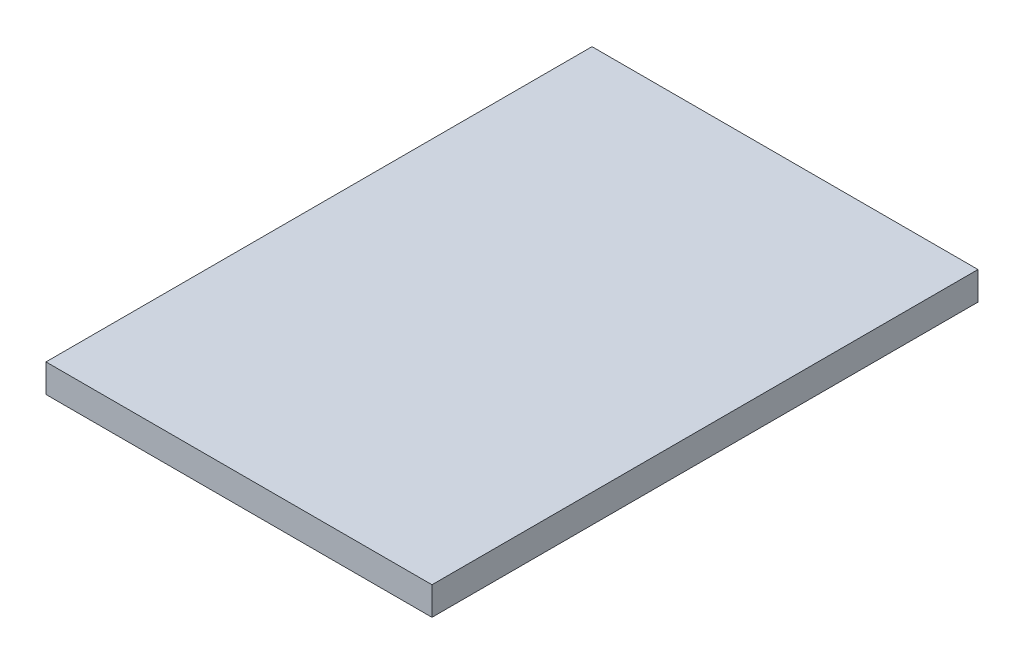
ISO-10303-21;
HEADER;
FILE_DESCRIPTION(('STEP AP214'),'2;1');
FILE_NAME('part.step','',(''),(''),'','','');
FILE_SCHEMA(('AUTOMOTIVE_DESIGN { 1 0 10303 214 1 1 1 1 }'));
ENDSEC;
DATA;
#1=APPLICATION_CONTEXT('core data for automotive mechanical design processes');
#2=APPLICATION_PROTOCOL_DEFINITION('international standard','automotive_design',2000,#1);
#3=PRODUCT_CONTEXT('',#1,'mechanical');
#4=PRODUCT('Part','Part','',(#3));
#5=PRODUCT_RELATED_PRODUCT_CATEGORY('part','',(#4));
#6=PRODUCT_DEFINITION_FORMATION('','',#4);
#7=PRODUCT_DEFINITION_CONTEXT('part definition',#1,'design');
#8=PRODUCT_DEFINITION('design','',#6,#7);
#9=PRODUCT_DEFINITION_SHAPE('','',#8);
#10=(LENGTH_UNIT() NAMED_UNIT(*) SI_UNIT(.MILLI.,.METRE.));
#11=(NAMED_UNIT(*) PLANE_ANGLE_UNIT() SI_UNIT($,.RADIAN.));
#12=(NAMED_UNIT(*) SI_UNIT($,.STERADIAN.) SOLID_ANGLE_UNIT());
#13=UNCERTAINTY_MEASURE_WITH_UNIT(LENGTH_MEASURE(1.E-05),#10,'distance_accuracy_value','');
#14=(GEOMETRIC_REPRESENTATION_CONTEXT(3) GLOBAL_UNCERTAINTY_ASSIGNED_CONTEXT((#13)) GLOBAL_UNIT_ASSIGNED_CONTEXT((#10,
#11,#12)) REPRESENTATION_CONTEXT('',''));
#15=CARTESIAN_POINT('',(0.,0.,0.));
#16=DIRECTION('',(0.,0.,1.));
#17=DIRECTION('',(1.,0.,0.));
#18=AXIS2_PLACEMENT_3D('',#15,#16,#17);
#19=CARTESIAN_POINT('',(-30.,0.,580.));
#20=DIRECTION('',(-1.,0.,0.));
#21=DIRECTION('',(0.,0.,1.));
#22=AXIS2_PLACEMENT_3D('',#19,#20,#21);
#23=PLANE('',#22);
#24=DIRECTION('',(0.,1.,0.));
#25=VECTOR('',#24,1.);
#26=CARTESIAN_POINT('',(-30.,0.,0.));
#27=LINE('',#26,#25);
#28=CARTESIAN_POINT('',(-30.,0.,0.));
#29=VERTEX_POINT('',#28);
#30=CARTESIAN_POINT('',(-30.,30.,0.));
#31=VERTEX_POINT('',#30);
#32=EDGE_CURVE('E98',#29,#31,#27,.T.);
#33=ORIENTED_EDGE('',*,*,#32,.F.);
#34=DIRECTION('',(0.,0.,-1.));
#35=VECTOR('',#34,1.);
#36=CARTESIAN_POINT('',(-30.,0.,580.));
#37=LINE('',#36,#35);
#38=CARTESIAN_POINT('',(-30.,0.,580.));
#39=VERTEX_POINT('',#38);
#40=EDGE_CURVE('E11',#39,#29,#37,.T.);
#41=ORIENTED_EDGE('',*,*,#40,.F.);
#42=DIRECTION('',(0.,1.,0.));
#43=VECTOR('',#42,1.);
#44=CARTESIAN_POINT('',(-30.,0.,580.));
#45=LINE('',#44,#43);
#46=CARTESIAN_POINT('',(-30.,30.,580.));
#47=VERTEX_POINT('',#46);
#48=EDGE_CURVE('E92',#39,#47,#45,.T.);
#49=ORIENTED_EDGE('',*,*,#48,.T.);
#50=DIRECTION('',(0.,0.,-1.));
#51=VECTOR('',#50,1.);
#52=CARTESIAN_POINT('',(-30.,30.,580.));
#53=LINE('',#52,#51);
#54=EDGE_CURVE('E73',#47,#31,#53,.T.);
#55=ORIENTED_EDGE('',*,*,#54,.T.);
#56=EDGE_LOOP('',(#33,#41,#49,#55));
#57=FACE_BOUND('',#56,.T.);
#58=ADVANCED_FACE('F35',(#57),#23,.T.);
#59=CARTESIAN_POINT('',(0.,0.,580.));
#60=DIRECTION('',(0.,-1.,0.));
#61=DIRECTION('',(0.,0.,-1.));
#62=AXIS2_PLACEMENT_3D('',#59,#60,#61);
#63=PLANE('',#62);
#64=DIRECTION('',(-1.,0.,0.));
#65=VECTOR('',#64,1.);
#66=CARTESIAN_POINT('',(0.,0.,0.));
#67=LINE('',#66,#65);
#68=CARTESIAN_POINT('',(380.,0.,0.));
#69=VERTEX_POINT('',#68);
#70=EDGE_CURVE('E86',#69,#29,#67,.T.);
#71=ORIENTED_EDGE('',*,*,#70,.F.);
#72=DIRECTION('',(0.,0.,-1.));
#73=VECTOR('',#72,1.);
#74=CARTESIAN_POINT('',(380.,0.,580.));
#75=LINE('',#74,#73);
#76=CARTESIAN_POINT('',(380.,0.,580.));
#77=VERTEX_POINT('',#76);
#78=EDGE_CURVE('E43',#77,#69,#75,.T.);
#79=ORIENTED_EDGE('',*,*,#78,.F.);
#80=DIRECTION('',(-1.,0.,0.));
#81=VECTOR('',#80,1.);
#82=CARTESIAN_POINT('',(0.,0.,580.));
#83=LINE('',#82,#81);
#84=EDGE_CURVE('E84',#77,#39,#83,.T.);
#85=ORIENTED_EDGE('',*,*,#84,.T.);
#86=ORIENTED_EDGE('',*,*,#40,.T.);
#87=EDGE_LOOP('',(#71,#79,#85,#86));
#88=FACE_BOUND('',#87,.T.);
#89=ADVANCED_FACE('F82',(#88),#63,.T.);
#90=CARTESIAN_POINT('',(380.,0.,580.));
#91=DIRECTION('',(-1.,0.,0.));
#92=DIRECTION('',(0.,0.,1.));
#93=AXIS2_PLACEMENT_3D('',#90,#91,#92);
#94=PLANE('',#93);
#95=DIRECTION('',(0.,1.,0.));
#96=VECTOR('',#95,1.);
#97=CARTESIAN_POINT('',(380.,0.,0.));
#98=LINE('',#97,#96);
#99=CARTESIAN_POINT('',(380.,30.,0.));
#100=VERTEX_POINT('',#99);
#101=EDGE_CURVE('E66',#69,#100,#98,.T.);
#102=ORIENTED_EDGE('',*,*,#101,.T.);
#103=DIRECTION('',(0.,0.,-1.));
#104=VECTOR('',#103,1.);
#105=CARTESIAN_POINT('',(380.,30.,580.));
#106=LINE('',#105,#104);
#107=CARTESIAN_POINT('',(380.,30.,580.));
#108=VERTEX_POINT('',#107);
#109=EDGE_CURVE('E87',#108,#100,#106,.T.);
#110=ORIENTED_EDGE('',*,*,#109,.F.);
#111=DIRECTION('',(0.,1.,0.));
#112=VECTOR('',#111,1.);
#113=CARTESIAN_POINT('',(380.,0.,580.));
#114=LINE('',#113,#112);
#115=EDGE_CURVE('E88',#77,#108,#114,.T.);
#116=ORIENTED_EDGE('',*,*,#115,.F.);
#117=ORIENTED_EDGE('',*,*,#78,.T.);
#118=EDGE_LOOP('',(#102,#110,#116,#117));
#119=FACE_BOUND('',#118,.T.);
#120=ADVANCED_FACE('F89',(#119),#94,.F.);
#121=CARTESIAN_POINT('',(0.,30.,580.));
#122=DIRECTION('',(0.,-1.,0.));
#123=DIRECTION('',(1.,0.,0.));
#124=AXIS2_PLACEMENT_3D('',#121,#122,#123);
#125=PLANE('',#124);
#126=DIRECTION('',(-1.,0.,0.));
#127=VECTOR('',#126,1.);
#128=CARTESIAN_POINT('',(0.,30.,0.));
#129=LINE('',#128,#127);
#130=EDGE_CURVE('E94',#100,#31,#129,.T.);
#131=ORIENTED_EDGE('',*,*,#130,.T.);
#132=ORIENTED_EDGE('',*,*,#54,.F.);
#133=DIRECTION('',(-1.,0.,0.));
#134=VECTOR('',#133,1.);
#135=CARTESIAN_POINT('',(0.,30.,580.));
#136=LINE('',#135,#134);
#137=EDGE_CURVE('E51',#108,#47,#136,.T.);
#138=ORIENTED_EDGE('',*,*,#137,.F.);
#139=ORIENTED_EDGE('',*,*,#109,.T.);
#140=EDGE_LOOP('',(#131,#132,#138,#139));
#141=FACE_BOUND('',#140,.T.);
#142=ADVANCED_FACE('F107',(#141),#125,.F.);
#143=CARTESIAN_POINT('',(0.,0.,580.));
#144=DIRECTION('',(0.,0.,1.));
#145=DIRECTION('',(1.,0.,0.));
#146=AXIS2_PLACEMENT_3D('',#143,#144,#145);
#147=PLANE('',#146);
#148=ORIENTED_EDGE('',*,*,#48,.F.);
#149=ORIENTED_EDGE('',*,*,#84,.F.);
#150=ORIENTED_EDGE('',*,*,#115,.T.);
#151=ORIENTED_EDGE('',*,*,#137,.T.);
#152=EDGE_LOOP('',(#148,#149,#150,#151));
#153=FACE_BOUND('',#152,.T.);
#154=ADVANCED_FACE('F91',(#153),#147,.T.);
#155=CARTESIAN_POINT('',(0.,0.,0.));
#156=DIRECTION('',(0.,0.,1.));
#157=DIRECTION('',(1.,0.,0.));
#158=AXIS2_PLACEMENT_3D('',#155,#156,#157);
#159=PLANE('',#158);
#160=ORIENTED_EDGE('',*,*,#32,.T.);
#161=ORIENTED_EDGE('',*,*,#130,.F.);
#162=ORIENTED_EDGE('',*,*,#101,.F.);
#163=ORIENTED_EDGE('',*,*,#70,.T.);
#164=EDGE_LOOP('',(#160,#161,#162,#163));
#165=FACE_BOUND('',#164,.T.);
#166=ADVANCED_FACE('F109',(#165),#159,.F.);
#167=CLOSED_SHELL('',(#58,#89,#120,#142,#154,#166));
#168=MANIFOLD_SOLID_BREP('B2',#167);
#169=ADVANCED_BREP_SHAPE_REPRESENTATION('',(#18,#168),#14);
#170=SHAPE_DEFINITION_REPRESENTATION(#9,#169);
ENDSEC;
END-ISO-10303-21;
